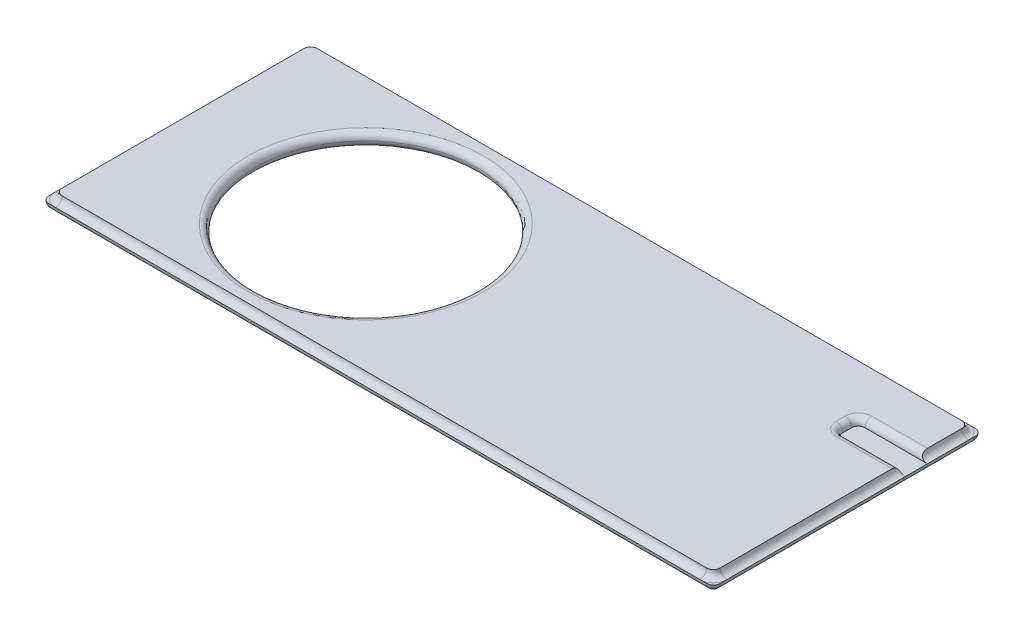
ISO-10303-21;
HEADER;
FILE_DESCRIPTION(('STEP AP214'),'2;1');
FILE_NAME('part.step','',(''),(''),'','','');
FILE_SCHEMA(('AUTOMOTIVE_DESIGN { 1 0 10303 214 1 1 1 1 }'));
ENDSEC;
DATA;
#1=APPLICATION_CONTEXT('core data for automotive mechanical design processes');
#2=APPLICATION_PROTOCOL_DEFINITION('international standard','automotive_design',2000,#1);
#3=PRODUCT_CONTEXT('',#1,'mechanical');
#4=PRODUCT('Part','Part','',(#3));
#5=PRODUCT_RELATED_PRODUCT_CATEGORY('part','',(#4));
#6=PRODUCT_DEFINITION_FORMATION('','',#4);
#7=PRODUCT_DEFINITION_CONTEXT('part definition',#1,'design');
#8=PRODUCT_DEFINITION('design','',#6,#7);
#9=PRODUCT_DEFINITION_SHAPE('','',#8);
#10=(LENGTH_UNIT() NAMED_UNIT(*) SI_UNIT(.MILLI.,.METRE.));
#11=(NAMED_UNIT(*) PLANE_ANGLE_UNIT() SI_UNIT($,.RADIAN.));
#12=(NAMED_UNIT(*) SI_UNIT($,.STERADIAN.) SOLID_ANGLE_UNIT());
#13=UNCERTAINTY_MEASURE_WITH_UNIT(LENGTH_MEASURE(1.E-05),#10,'distance_accuracy_value','');
#14=(GEOMETRIC_REPRESENTATION_CONTEXT(3) GLOBAL_UNCERTAINTY_ASSIGNED_CONTEXT((#13)) GLOBAL_UNIT_ASSIGNED_CONTEXT((#10,
#11,#12)) REPRESENTATION_CONTEXT('',''));
#15=CARTESIAN_POINT('',(0.,0.,0.));
#16=DIRECTION('',(0.,0.,1.));
#17=DIRECTION('',(1.,0.,0.));
#18=AXIS2_PLACEMENT_3D('',#15,#16,#17);
#19=CARTESIAN_POINT('',(100.,4.,-38.));
#20=DIRECTION('',(0.,0.,1.));
#21=DIRECTION('',(1.,0.,0.));
#22=AXIS2_PLACEMENT_3D('',#19,#20,#21);
#23=CYLINDRICAL_SURFACE('',#22,2.);
#24=DIRECTION('',(0.,0.,-1.));
#25=VECTOR('',#24,1.);
#26=CARTESIAN_POINT('',(100.,2.,36.));
#27=LINE('',#26,#25);
#28=CARTESIAN_POINT('',(100.,2.00000000000001,-17.1608981936858));
#29=VERTEX_POINT('',#28);
#30=CARTESIAN_POINT('',(100.,2.,36.));
#31=VERTEX_POINT('',#30);
#32=EDGE_CURVE('E216',#29,#31,#27,.F.);
#33=ORIENTED_EDGE('',*,*,#32,.F.);
#34=CARTESIAN_POINT('',(100.,2.00000000000001,-17.1608981936858));
#35=CARTESIAN_POINT('',(99.9443237196091,1.99999477382585,-17.1608812763882));
#36=CARTESIAN_POINT('',(99.8886498864098,2.0023248431153,-17.160897776983));
#37=CARTESIAN_POINT('',(99.7776902044235,2.01161556562429,-17.1608743192331));
#38=CARTESIAN_POINT('',(99.7224043532766,2.01857619065193,-17.1608343612321));
#39=CARTESIAN_POINT('',(99.6125064812738,2.03710429745034,-17.1605744660175));
#40=CARTESIAN_POINT('',(99.557895816533,2.04867986003021,-17.1603542123878));
#41=CARTESIAN_POINT('',(99.4498488761123,2.07634537812475,-17.1594877838668));
#42=CARTESIAN_POINT('',(99.3964125852468,2.09243527522871,-17.1588416144862));
#43=CARTESIAN_POINT('',(99.2383255375123,2.14735806605441,-17.1558063044473));
#44=CARTESIAN_POINT('',(99.1359163902609,2.19284070390969,-17.1523202018416));
#45=CARTESIAN_POINT('',(98.9404620253555,2.30006932532299,-17.1389899789227));
#46=CARTESIAN_POINT('',(98.8474083301739,2.36180039826343,-17.129151675835));
#47=CARTESIAN_POINT('',(98.7189707398691,2.46318241639044,-17.1068157486575));
#48=CARTESIAN_POINT('',(98.6787150797561,2.49767166863702,-17.098346324573));
#49=CARTESIAN_POINT('',(98.6014464543016,2.56933008262882,-17.0785126127619));
#50=CARTESIAN_POINT('',(98.5644317140234,2.60649775690457,-17.0671499230701));
#51=CARTESIAN_POINT('',(98.4939899390705,2.68294568903481,-17.0411138954848));
#52=CARTESIAN_POINT('',(98.4605593355672,2.72222378584753,-17.0264438968103));
#53=CARTESIAN_POINT('',(98.3975035692162,2.80224974734088,-16.9934574709362));
#54=CARTESIAN_POINT('',(98.3678777455406,2.84299735521259,-16.9751416783641));
#55=CARTESIAN_POINT('',(98.2925000429409,2.95514256017667,-16.9198566774541));
#56=CARTESIAN_POINT('',(98.2506459111748,3.02732535142565,-16.8789960119501));
#57=CARTESIAN_POINT('',(98.1787152328623,3.16974975751624,-16.7853833536057));
#58=CARTESIAN_POINT('',(98.1486391987491,3.23999128777529,-16.7326308435406));
#59=CARTESIAN_POINT('',(98.1003145339163,3.37088385385184,-16.6195708767724));
#60=CARTESIAN_POINT('',(98.0814820317776,3.4318546820201,-16.5598775226313));
#61=CARTESIAN_POINT('',(98.0512168171712,3.54639103408929,-16.4321346721791));
#62=CARTESIAN_POINT('',(98.039785886046,3.59995477288208,-16.3640831689899));
#63=CARTESIAN_POINT('',(98.0214307329307,3.70290029683522,-16.2140869790337));
#64=CARTESIAN_POINT('',(98.0150638480792,3.75134497193227,-16.1314338943138));
#65=CARTESIAN_POINT('',(98.0062783460999,3.83600253521547,-15.9598081316612));
#66=CARTESIAN_POINT('',(98.0038630193132,3.87220520998761,-15.8708302515186));
#67=CARTESIAN_POINT('',(98.0016146127977,3.91807160660776,-15.7298972361987));
#68=CARTESIAN_POINT('',(98.0011077110859,3.93233291451641,-15.6793980566494));
#69=CARTESIAN_POINT('',(98.000427662594,3.9568490683612,-15.5774189206616));
#70=CARTESIAN_POINT('',(98.0002545455301,3.96710355751288,-15.5259388773106));
#71=CARTESIAN_POINT('',(98.0000501120018,3.98352879910622,-15.422358893616));
#72=CARTESIAN_POINT('',(98.0000187286014,3.98970147806949,-15.3702592575432));
#73=CARTESIAN_POINT('',(98.0000003652994,3.99793901785092,-15.2657397312799));
#74=CARTESIAN_POINT('',(98.0000133824983,4.00000414689747,-15.2133198622253));
#75=CARTESIAN_POINT('',(98.,4.00000000000001,-15.1608981936858));
#76=B_SPLINE_CURVE_WITH_KNOTS('',3,(#34,#35,#36,#37,#38,#39,#40,#41,#42,#43,#44,#45,#46,#47,#48,
#49,#50,#51,#52,#53,#54,#55,#56,#57,#58,#59,#60,#61,#62,#63,#64,#65,#66,#67,#68,#69,#70,#71,#72,
#73,#74,#75),.UNSPECIFIED.,.F.,.F.,(4,2,2,2,2,2,2,2,2,2,2,2,2,2,2,2,2,2,2,2,4),(0.,
0.166975669456327,0.333950322335784,0.501218642994518,0.668484799478483,1.00307655016575,
1.33736232180719,1.49820683683046,1.65896270472558,1.81955698688305,1.98012333861254,
2.25720233723891,2.53429338948394,2.79534445721546,3.05645832900396,3.3433892350094,
3.63055893820404,3.78785058830356,3.94515624114186,4.10238759619616,4.25960868349995),.UNSPECIFIED.);
#77=CARTESIAN_POINT('',(98.,4.00000000000001,-15.1608981936858));
#78=VERTEX_POINT('',#77);
#79=EDGE_CURVE('E55',#29,#78,#76,.T.);
#80=ORIENTED_EDGE('',*,*,#79,.T.);
#81=DIRECTION('',(0.,0.,-1.));
#82=VECTOR('',#81,1.);
#83=CARTESIAN_POINT('',(98.,4.00000000000001,-38.));
#84=LINE('',#83,#82);
#85=CARTESIAN_POINT('',(98.,4.00000000000001,36.));
#86=VERTEX_POINT('',#85);
#87=EDGE_CURVE('E231',#86,#78,#84,.T.);
#88=ORIENTED_EDGE('',*,*,#87,.F.);
#89=CARTESIAN_POINT('',(100.,4.,36.));
#90=DIRECTION('',(0.,0.,1.));
#91=DIRECTION('',(1.,0.,0.));
#92=AXIS2_PLACEMENT_3D('',#89,#90,#91);
#93=CIRCLE('',#92,2.);
#94=EDGE_CURVE('E329',#86,#31,#93,.T.);
#95=ORIENTED_EDGE('',*,*,#94,.T.);
#96=EDGE_LOOP('',(#33,#80,#88,#95));
#97=FACE_BOUND('',#96,.T.);
#98=ADVANCED_FACE('F45',(#97),#23,.F.);
#99=CARTESIAN_POINT('',(98.,4.00000000000001,-25.7408981936858));
#100=VERTEX_POINT('',#99);
#101=CARTESIAN_POINT('',(98.,4.00000000000001,-36.));
#102=VERTEX_POINT('',#101);
#103=EDGE_CURVE('E195',#100,#102,#84,.T.);
#104=ORIENTED_EDGE('',*,*,#103,.F.);
#105=CARTESIAN_POINT('',(98.,4.00000000000001,-25.7408981936858));
#106=CARTESIAN_POINT('',(98.0000169172976,4.00000522617416,-25.6852219132949));
#107=CARTESIAN_POINT('',(98.0000004167028,3.9976751568847,-25.6295480800955));
#108=CARTESIAN_POINT('',(98.0000238744527,3.98838443437572,-25.5185883981093));
#109=CARTESIAN_POINT('',(98.0000638324536,3.98142380934808,-25.4633025469623));
#110=CARTESIAN_POINT('',(98.0003237276683,3.96289570254967,-25.3534046749595));
#111=CARTESIAN_POINT('',(98.000543981298,3.9513201399698,-25.2987940102187));
#112=CARTESIAN_POINT('',(98.001410409819,3.92365462187526,-25.190747069798));
#113=CARTESIAN_POINT('',(98.0020565791995,3.90756472477131,-25.1373107789326));
#114=CARTESIAN_POINT('',(98.0050918892385,3.85264193394561,-24.9792237311981));
#115=CARTESIAN_POINT('',(98.0085779918441,3.80715929609032,-24.8768145839466));
#116=CARTESIAN_POINT('',(98.021908214763,3.69993067467702,-24.6813602190412));
#117=CARTESIAN_POINT('',(98.0317465178508,3.63819960173658,-24.5883065238596));
#118=CARTESIAN_POINT('',(98.0540824450283,3.53681758360958,-24.4598689335549));
#119=CARTESIAN_POINT('',(98.0625518691128,3.502328331363,-24.4196132734419));
#120=CARTESIAN_POINT('',(98.0823855809239,3.43066991737119,-24.3423446479874));
#121=CARTESIAN_POINT('',(98.0937482706156,3.39350224309545,-24.3053299077092));
#122=CARTESIAN_POINT('',(98.1197842982009,3.31705431096521,-24.2348881327563));
#123=CARTESIAN_POINT('',(98.1344542968754,3.2777762141525,-24.201457529253));
#124=CARTESIAN_POINT('',(98.1674407227496,3.19775025265914,-24.138401762902));
#125=CARTESIAN_POINT('',(98.1857565153216,3.15700264478743,-24.1087759392263));
#126=CARTESIAN_POINT('',(98.2410415162317,3.04485743982335,-24.0333982366267));
#127=CARTESIAN_POINT('',(98.2819021817357,2.97267464857437,-23.9915441048605));
#128=CARTESIAN_POINT('',(98.37551484008,2.83025024248378,-23.919613426548));
#129=CARTESIAN_POINT('',(98.4282673501451,2.76000871222472,-23.8895373924349));
#130=CARTESIAN_POINT('',(98.5413273169133,2.62911614614817,-23.841212727602));
#131=CARTESIAN_POINT('',(98.6010206710544,2.56814531797991,-23.8223802254634));
#132=CARTESIAN_POINT('',(98.7287635215066,2.45360896591072,-23.792115010857));
#133=CARTESIAN_POINT('',(98.7968150246959,2.40004522711794,-23.7806840797318));
#134=CARTESIAN_POINT('',(98.9468112146521,2.29709970316479,-23.7623289266165));
#135=CARTESIAN_POINT('',(99.0294642993719,2.24865502806774,-23.755962041765));
#136=CARTESIAN_POINT('',(99.2010900620245,2.16399746478454,-23.7471765397856));
#137=CARTESIAN_POINT('',(99.2900679421672,2.1277947900124,-23.7447612129989));
#138=CARTESIAN_POINT('',(99.4310009574871,2.08192839339224,-23.7425128064834));
#139=CARTESIAN_POINT('',(99.4815001370364,2.0676670854836,-23.7420059047716));
#140=CARTESIAN_POINT('',(99.5834792730242,2.04315093163881,-23.7413258562797));
#141=CARTESIAN_POINT('',(99.6349593163752,2.03289644248713,-23.7411527392159));
#142=CARTESIAN_POINT('',(99.7385393000697,2.01647120089379,-23.7409483056875));
#143=CARTESIAN_POINT('',(99.7906389361425,2.01029852193052,-23.7409169222872));
#144=CARTESIAN_POINT('',(99.8951584624058,2.00206098214909,-23.7408985589852));
#145=CARTESIAN_POINT('',(99.9475783314605,1.99999585310255,-23.740911576184));
#146=CARTESIAN_POINT('',(100.,2.,-23.7408981936858));
#147=B_SPLINE_CURVE_WITH_KNOTS('',3,(#105,#106,#107,#108,#109,#110,#111,#112,#113,#114,#115,
#116,#117,#118,#119,#120,#121,#122,#123,#124,#125,#126,#127,#128,#129,#130,#131,#132,#133,#134,
#135,#136,#137,#138,#139,#140,#141,#142,#143,#144,#145,#146),.UNSPECIFIED.,.F.,.F.,(4,2,2,2,2,2,
2,2,2,2,2,2,2,2,2,2,2,2,2,2,4),(0.,0.166975669456348,0.333950322335805,0.501218642994511,
0.668484799478483,1.00307655016576,1.33736232180719,1.49820683683045,1.65896270472556,
1.81955698688304,1.98012333861253,2.2572023372389,2.53429338948394,2.79534445721545,
3.05645832900396,3.34338923500941,3.63055893820404,3.78785058830358,3.94515624114185,
4.10238759619614,4.25960868349993),.UNSPECIFIED.);
#148=CARTESIAN_POINT('',(100.,2.00000000000001,-23.7408981936858));
#149=VERTEX_POINT('',#148);
#150=EDGE_CURVE('E11',#100,#149,#147,.T.);
#151=ORIENTED_EDGE('',*,*,#150,.T.);
#152=CARTESIAN_POINT('',(100.,2.,-36.));
#153=VERTEX_POINT('',#152);
#154=EDGE_CURVE('E193',#153,#149,#27,.F.);
#155=ORIENTED_EDGE('',*,*,#154,.F.);
#156=CARTESIAN_POINT('',(100.,4.,-36.));
#157=DIRECTION('',(0.,0.,1.));
#158=DIRECTION('',(1.,0.,0.));
#159=AXIS2_PLACEMENT_3D('',#156,#157,#158);
#160=CIRCLE('',#159,2.);
#161=EDGE_CURVE('E317',#102,#153,#160,.T.);
#162=ORIENTED_EDGE('',*,*,#161,.F.);
#163=EDGE_LOOP('',(#104,#151,#155,#162));
#164=FACE_BOUND('',#163,.T.);
#165=ADVANCED_FACE('F190',(#164),#23,.F.);
#166=CARTESIAN_POINT('',(0.,2.,0.));
#167=DIRECTION('',(0.,-1.,0.));
#168=DIRECTION('',(0.,0.,-1.));
#169=AXIS2_PLACEMENT_3D('',#166,#167,#168);
#170=PLANE('',#169);
#171=DIRECTION('',(1.,0.,0.));
#172=VECTOR('',#171,1.);
#173=CARTESIAN_POINT('',(100.,2.,40.));
#174=LINE('',#173,#172);
#175=CARTESIAN_POINT('',(-98.,2.,40.));
#176=VERTEX_POINT('',#175);
#177=CARTESIAN_POINT('',(-96.,2.,40.));
#178=VERTEX_POINT('',#177);
#179=EDGE_CURVE('E239',#176,#178,#174,.T.);
#180=ORIENTED_EDGE('',*,*,#179,.T.);
#181=CARTESIAN_POINT('',(-96.,2.,36.));
#182=DIRECTION('',(0.,-1.,0.));
#183=DIRECTION('',(0.,0.,-1.));
#184=AXIS2_PLACEMENT_3D('',#181,#182,#183);
#185=CIRCLE('',#184,4.);
#186=CARTESIAN_POINT('',(-100.,2.,36.));
#187=VERTEX_POINT('',#186);
#188=EDGE_CURVE('E282',#178,#187,#185,.T.);
#189=ORIENTED_EDGE('',*,*,#188,.T.);
#190=DIRECTION('',(0.,0.,1.));
#191=VECTOR('',#190,1.);
#192=CARTESIAN_POINT('',(-100.,2.,-40.));
#193=LINE('',#192,#191);
#194=CARTESIAN_POINT('',(-100.,2.,38.));
#195=VERTEX_POINT('',#194);
#196=EDGE_CURVE('E235',#187,#195,#193,.T.);
#197=ORIENTED_EDGE('',*,*,#196,.T.);
#198=CARTESIAN_POINT('',(-98.,2.,38.));
#199=DIRECTION('',(0.,-1.,0.));
#200=DIRECTION('',(0.,0.,-1.));
#201=AXIS2_PLACEMENT_3D('',#198,#199,#200);
#202=CIRCLE('',#201,2.);
#203=EDGE_CURVE('E249',#195,#176,#202,.F.);
#204=ORIENTED_EDGE('',*,*,#203,.T.);
#205=EDGE_LOOP('',(#180,#189,#197,#204));
#206=FACE_BOUND('',#205,.T.);
#207=ADVANCED_FACE('F513',(#206),#170,.F.);
#208=CARTESIAN_POINT('',(-100.,2.,-38.));
#209=VERTEX_POINT('',#208);
#210=CARTESIAN_POINT('',(-100.,2.,-36.));
#211=VERTEX_POINT('',#210);
#212=EDGE_CURVE('E236',#209,#211,#193,.T.);
#213=ORIENTED_EDGE('',*,*,#212,.T.);
#214=CARTESIAN_POINT('',(-96.,2.,-36.));
#215=DIRECTION('',(0.,-1.,0.));
#216=DIRECTION('',(0.,0.,-1.));
#217=AXIS2_PLACEMENT_3D('',#214,#215,#216);
#218=CIRCLE('',#217,4.);
#219=CARTESIAN_POINT('',(-96.,2.,-40.));
#220=VERTEX_POINT('',#219);
#221=EDGE_CURVE('E280',#211,#220,#218,.T.);
#222=ORIENTED_EDGE('',*,*,#221,.T.);
#223=DIRECTION('',(-1.,0.,0.));
#224=VECTOR('',#223,1.);
#225=CARTESIAN_POINT('',(100.,2.,-40.));
#226=LINE('',#225,#224);
#227=CARTESIAN_POINT('',(-98.,2.,-40.));
#228=VERTEX_POINT('',#227);
#229=EDGE_CURVE('E245',#220,#228,#226,.T.);
#230=ORIENTED_EDGE('',*,*,#229,.T.);
#231=CARTESIAN_POINT('',(-98.,2.,-38.));
#232=DIRECTION('',(0.,-1.,0.));
#233=DIRECTION('',(0.,0.,-1.));
#234=AXIS2_PLACEMENT_3D('',#231,#232,#233);
#235=CIRCLE('',#234,2.);
#236=EDGE_CURVE('E255',#228,#209,#235,.F.);
#237=ORIENTED_EDGE('',*,*,#236,.T.);
#238=EDGE_LOOP('',(#213,#222,#230,#237));
#239=FACE_BOUND('',#238,.T.);
#240=ADVANCED_FACE('F456',(#239),#170,.F.);
#241=CARTESIAN_POINT('',(98.,2.,-40.));
#242=VERTEX_POINT('',#241);
#243=CARTESIAN_POINT('',(96.,2.,-40.));
#244=VERTEX_POINT('',#243);
#245=EDGE_CURVE('E246',#242,#244,#226,.T.);
#246=ORIENTED_EDGE('',*,*,#245,.T.);
#247=CARTESIAN_POINT('',(96.,2.,-36.));
#248=DIRECTION('',(0.,-1.,0.));
#249=DIRECTION('',(0.,0.,-1.));
#250=AXIS2_PLACEMENT_3D('',#247,#248,#249);
#251=CIRCLE('',#250,4.);
#252=EDGE_CURVE('E278',#244,#153,#251,.T.);
#253=ORIENTED_EDGE('',*,*,#252,.T.);
#254=DIRECTION('',(0.,0.,-1.));
#255=VECTOR('',#254,1.);
#256=CARTESIAN_POINT('',(100.,2.,-40.));
#257=LINE('',#256,#255);
#258=CARTESIAN_POINT('',(100.,2.,-38.));
#259=VERTEX_POINT('',#258);
#260=EDGE_CURVE('E214',#153,#259,#257,.T.);
#261=ORIENTED_EDGE('',*,*,#260,.T.);
#262=CARTESIAN_POINT('',(98.,2.,-38.));
#263=DIRECTION('',(0.,-1.,0.));
#264=DIRECTION('',(0.,0.,-1.));
#265=AXIS2_PLACEMENT_3D('',#262,#263,#264);
#266=CIRCLE('',#265,2.);
#267=EDGE_CURVE('E253',#259,#242,#266,.F.);
#268=ORIENTED_EDGE('',*,*,#267,.T.);
#269=EDGE_LOOP('',(#246,#253,#261,#268));
#270=FACE_BOUND('',#269,.T.);
#271=ADVANCED_FACE('F469',(#270),#170,.F.);
#272=CARTESIAN_POINT('',(100.,2.,38.));
#273=VERTEX_POINT('',#272);
#274=EDGE_CURVE('E242',#273,#31,#257,.T.);
#275=ORIENTED_EDGE('',*,*,#274,.T.);
#276=CARTESIAN_POINT('',(96.,2.,36.));
#277=DIRECTION('',(0.,-1.,0.));
#278=DIRECTION('',(0.,0.,-1.));
#279=AXIS2_PLACEMENT_3D('',#276,#277,#278);
#280=CIRCLE('',#279,4.);
#281=CARTESIAN_POINT('',(96.,2.,40.));
#282=VERTEX_POINT('',#281);
#283=EDGE_CURVE('E276',#31,#282,#280,.T.);
#284=ORIENTED_EDGE('',*,*,#283,.T.);
#285=CARTESIAN_POINT('',(98.,2.,40.));
#286=VERTEX_POINT('',#285);
#287=EDGE_CURVE('E238',#282,#286,#174,.T.);
#288=ORIENTED_EDGE('',*,*,#287,.T.);
#289=CARTESIAN_POINT('',(98.,2.,38.));
#290=DIRECTION('',(0.,-1.,0.));
#291=DIRECTION('',(0.,0.,-1.));
#292=AXIS2_PLACEMENT_3D('',#289,#290,#291);
#293=CIRCLE('',#292,2.);
#294=EDGE_CURVE('E251',#286,#273,#293,.F.);
#295=ORIENTED_EDGE('',*,*,#294,.T.);
#296=EDGE_LOOP('',(#275,#284,#288,#295));
#297=FACE_BOUND('',#296,.T.);
#298=ADVANCED_FACE('F427',(#297),#170,.F.);
#299=CARTESIAN_POINT('',(0.,0.,0.));
#300=DIRECTION('',(0.,-1.,0.));
#301=DIRECTION('',(0.,0.,-1.));
#302=AXIS2_PLACEMENT_3D('',#299,#300,#301);
#303=PLANE('',#302);
#304=CARTESIAN_POINT('',(-43.56,0.,0.));
#305=DIRECTION('',(0.,-1.,0.));
#306=DIRECTION('',(0.,0.,-1.));
#307=AXIS2_PLACEMENT_3D('',#304,#305,#306);
#308=CIRCLE('',#307,35.0721631171338);
#309=CARTESIAN_POINT('',(-43.56,0.,-35.0721631171338));
#310=VERTEX_POINT('',#309);
#311=EDGE_CURVE('E336',#310,#310,#308,.F.);
#312=ORIENTED_EDGE('',*,*,#311,.T.);
#313=EDGE_LOOP('',(#312));
#314=FACE_BOUND('',#313,.T.);
#315=DIRECTION('',(0.,0.,1.));
#316=VECTOR('',#315,1.);
#317=CARTESIAN_POINT('',(-98.,0.,-38.));
#318=LINE('',#317,#316);
#319=CARTESIAN_POINT('',(-98.,0.,38.));
#320=VERTEX_POINT('',#319);
#321=CARTESIAN_POINT('',(-98.,0.,-38.));
#322=VERTEX_POINT('',#321);
#323=EDGE_CURVE('E267',#320,#322,#318,.F.);
#324=ORIENTED_EDGE('',*,*,#323,.T.);
#325=DIRECTION('',(-1.,0.,0.));
#326=VECTOR('',#325,1.);
#327=CARTESIAN_POINT('',(98.,0.,-38.));
#328=LINE('',#327,#326);
#329=CARTESIAN_POINT('',(98.,0.,-38.));
#330=VERTEX_POINT('',#329);
#331=EDGE_CURVE('E273',#322,#330,#328,.F.);
#332=ORIENTED_EDGE('',*,*,#331,.T.);
#333=DIRECTION('',(0.,0.,-1.));
#334=VECTOR('',#333,1.);
#335=CARTESIAN_POINT('',(98.,0.,38.));
#336=LINE('',#335,#334);
#337=CARTESIAN_POINT('',(98.,0.,38.));
#338=VERTEX_POINT('',#337);
#339=EDGE_CURVE('E271',#330,#338,#336,.F.);
#340=ORIENTED_EDGE('',*,*,#339,.T.);
#341=DIRECTION('',(1.,0.,0.));
#342=VECTOR('',#341,1.);
#343=CARTESIAN_POINT('',(-98.,0.,38.));
#344=LINE('',#343,#342);
#345=EDGE_CURVE('E269',#338,#320,#344,.F.);
#346=ORIENTED_EDGE('',*,*,#345,.T.);
#347=EDGE_LOOP('',(#324,#332,#340,#346));
#348=FACE_BOUND('',#347,.T.);
#349=ADVANCED_FACE('F440',(#314,#348),#303,.T.);
#350=CARTESIAN_POINT('',(0.,4.00000000000001,0.));
#351=DIRECTION('',(0.,-1.,0.));
#352=DIRECTION('',(0.,0.,-1.));
#353=AXIS2_PLACEMENT_3D('',#350,#351,#352);
#354=PLANE('',#353);
#355=CARTESIAN_POINT('',(-43.56,4.00000000000001,0.));
#356=DIRECTION('',(0.,-1.,0.));
#357=DIRECTION('',(0.,0.,-1.));
#358=AXIS2_PLACEMENT_3D('',#355,#356,#357);
#359=CIRCLE('',#358,35.0721631171338);
#360=CARTESIAN_POINT('',(-43.56,4.00000000000001,-35.0721631171338));
#361=VERTEX_POINT('',#360);
#362=EDGE_CURVE('E339',#361,#361,#359,.T.);
#363=ORIENTED_EDGE('',*,*,#362,.T.);
#364=EDGE_LOOP('',(#363));
#365=FACE_BOUND('',#364,.T.);
#366=ORIENTED_EDGE('',*,*,#87,.T.);
#367=DIRECTION('',(1.,0.,0.));
#368=VECTOR('',#367,1.);
#369=CARTESIAN_POINT('',(0.,4.00000000000001,-15.1608981936858));
#370=LINE('',#369,#368);
#371=CARTESIAN_POINT('',(81.4188022011959,4.00000000000001,-15.1608981936858));
#372=VERTEX_POINT('',#371);
#373=EDGE_CURVE('E63',#78,#372,#370,.F.);
#374=ORIENTED_EDGE('',*,*,#373,.T.);
#375=CARTESIAN_POINT('',(81.4188022011959,4.00000000000001,-19.1608981936858));
#376=DIRECTION('',(0.,-1.,0.));
#377=DIRECTION('',(0.,0.,-1.));
#378=AXIS2_PLACEMENT_3D('',#375,#376,#377);
#379=CIRCLE('',#378,4.);
#380=CARTESIAN_POINT('',(77.4188022011959,4.00000000000001,-19.1608981936858));
#381=VERTEX_POINT('',#380);
#382=EDGE_CURVE('E352',#372,#381,#379,.T.);
#383=ORIENTED_EDGE('',*,*,#382,.T.);
#384=DIRECTION('',(0.,0.,1.));
#385=VECTOR('',#384,1.);
#386=CARTESIAN_POINT('',(77.4188022011959,4.00000000000001,0.));
#387=LINE('',#386,#385);
#388=CARTESIAN_POINT('',(77.4188022011959,4.00000000000001,-21.7408981936858));
#389=VERTEX_POINT('',#388);
#390=EDGE_CURVE('E350',#381,#389,#387,.F.);
#391=ORIENTED_EDGE('',*,*,#390,.T.);
#392=CARTESIAN_POINT('',(81.4188022011959,4.00000000000001,-21.7408981936858));
#393=DIRECTION('',(0.,-1.,0.));
#394=DIRECTION('',(0.,0.,-1.));
#395=AXIS2_PLACEMENT_3D('',#392,#393,#394);
#396=CIRCLE('',#395,4.);
#397=CARTESIAN_POINT('',(81.4188022011959,4.00000000000001,-25.7408981936858));
#398=VERTEX_POINT('',#397);
#399=EDGE_CURVE('E348',#389,#398,#396,.T.);
#400=ORIENTED_EDGE('',*,*,#399,.T.);
#401=DIRECTION('',(-1.,0.,0.));
#402=VECTOR('',#401,1.);
#403=CARTESIAN_POINT('',(0.,4.00000000000001,-25.7408981936857));
#404=LINE('',#403,#402);
#405=EDGE_CURVE('E346',#398,#100,#404,.F.);
#406=ORIENTED_EDGE('',*,*,#405,.T.);
#407=ORIENTED_EDGE('',*,*,#103,.T.);
#408=CARTESIAN_POINT('',(96.,4.00000000000001,-36.));
#409=DIRECTION('',(0.,-1.,0.));
#410=DIRECTION('',(0.,0.,-1.));
#411=AXIS2_PLACEMENT_3D('',#408,#409,#410);
#412=CIRCLE('',#411,2.);
#413=CARTESIAN_POINT('',(96.,4.00000000000001,-38.));
#414=VERTEX_POINT('',#413);
#415=EDGE_CURVE('E265',#102,#414,#412,.F.);
#416=ORIENTED_EDGE('',*,*,#415,.T.);
#417=DIRECTION('',(-1.,0.,0.));
#418=VECTOR('',#417,1.);
#419=CARTESIAN_POINT('',(98.,4.00000000000001,-38.));
#420=LINE('',#419,#418);
#421=CARTESIAN_POINT('',(-96.,4.00000000000001,-38.));
#422=VERTEX_POINT('',#421);
#423=EDGE_CURVE('E233',#414,#422,#420,.T.);
#424=ORIENTED_EDGE('',*,*,#423,.T.);
#425=CARTESIAN_POINT('',(-96.,4.00000000000001,-36.));
#426=DIRECTION('',(0.,-1.,0.));
#427=DIRECTION('',(0.,0.,-1.));
#428=AXIS2_PLACEMENT_3D('',#425,#426,#427);
#429=CIRCLE('',#428,2.);
#430=CARTESIAN_POINT('',(-98.,4.00000000000001,-36.));
#431=VERTEX_POINT('',#430);
#432=EDGE_CURVE('E258',#422,#431,#429,.F.);
#433=ORIENTED_EDGE('',*,*,#432,.T.);
#434=DIRECTION('',(0.,0.,1.));
#435=VECTOR('',#434,1.);
#436=CARTESIAN_POINT('',(-98.,4.00000000000001,-38.));
#437=LINE('',#436,#435);
#438=CARTESIAN_POINT('',(-98.,4.00000000000001,36.));
#439=VERTEX_POINT('',#438);
#440=EDGE_CURVE('E226',#431,#439,#437,.T.);
#441=ORIENTED_EDGE('',*,*,#440,.T.);
#442=CARTESIAN_POINT('',(-96.,4.00000000000001,36.));
#443=DIRECTION('',(0.,-1.,0.));
#444=DIRECTION('',(0.,0.,-1.));
#445=AXIS2_PLACEMENT_3D('',#442,#443,#444);
#446=CIRCLE('',#445,2.);
#447=CARTESIAN_POINT('',(-96.,4.00000000000001,38.));
#448=VERTEX_POINT('',#447);
#449=EDGE_CURVE('E260',#439,#448,#446,.F.);
#450=ORIENTED_EDGE('',*,*,#449,.T.);
#451=DIRECTION('',(1.,0.,0.));
#452=VECTOR('',#451,1.);
#453=CARTESIAN_POINT('',(98.,4.00000000000001,38.));
#454=LINE('',#453,#452);
#455=CARTESIAN_POINT('',(96.,4.00000000000001,38.));
#456=VERTEX_POINT('',#455);
#457=EDGE_CURVE('E228',#448,#456,#454,.T.);
#458=ORIENTED_EDGE('',*,*,#457,.T.);
#459=CARTESIAN_POINT('',(96.,4.00000000000001,36.));
#460=DIRECTION('',(0.,-1.,0.));
#461=DIRECTION('',(0.,0.,-1.));
#462=AXIS2_PLACEMENT_3D('',#459,#460,#461);
#463=CIRCLE('',#462,2.);
#464=EDGE_CURVE('E263',#456,#86,#463,.F.);
#465=ORIENTED_EDGE('',*,*,#464,.T.);
#466=EDGE_LOOP('',(#366,#374,#383,#391,#400,#406,#407,#416,#424,#433,#441,#450,#458,#465));
#467=FACE_BOUND('',#466,.T.);
#468=ADVANCED_FACE('F388',(#365,#467),#354,.F.);
#469=CARTESIAN_POINT('',(96.,4.,36.));
#470=DIRECTION('',(0.,-1.,0.));
#471=DIRECTION('',(0.,0.,-1.));
#472=AXIS2_PLACEMENT_3D('',#469,#470,#471);
#473=TOROIDAL_SURFACE('',#472,4.,2.);
#474=ORIENTED_EDGE('',*,*,#94,.F.);
#475=ORIENTED_EDGE('',*,*,#464,.F.);
#476=CARTESIAN_POINT('',(96.,4.,40.));
#477=DIRECTION('',(1.,0.,0.));
#478=DIRECTION('',(0.,0.,-1.));
#479=AXIS2_PLACEMENT_3D('',#476,#477,#478);
#480=CIRCLE('',#479,2.);
#481=EDGE_CURVE('E229',#282,#456,#480,.T.);
#482=ORIENTED_EDGE('',*,*,#481,.F.);
#483=ORIENTED_EDGE('',*,*,#283,.F.);
#484=EDGE_LOOP('',(#474,#475,#482,#483));
#485=FACE_BOUND('',#484,.T.);
#486=ADVANCED_FACE('F384',(#485),#473,.F.);
#487=CARTESIAN_POINT('',(98.,4.,40.));
#488=DIRECTION('',(-1.,0.,0.));
#489=DIRECTION('',(0.,0.,1.));
#490=AXIS2_PLACEMENT_3D('',#487,#488,#489);
#491=CYLINDRICAL_SURFACE('',#490,2.);
#492=ORIENTED_EDGE('',*,*,#481,.T.);
#493=ORIENTED_EDGE('',*,*,#457,.F.);
#494=CARTESIAN_POINT('',(-96.,4.,40.));
#495=DIRECTION('',(1.,0.,0.));
#496=DIRECTION('',(0.,0.,-1.));
#497=AXIS2_PLACEMENT_3D('',#494,#495,#496);
#498=CIRCLE('',#497,2.);
#499=EDGE_CURVE('E327',#178,#448,#498,.T.);
#500=ORIENTED_EDGE('',*,*,#499,.F.);
#501=DIRECTION('',(1.,0.,0.));
#502=VECTOR('',#501,1.);
#503=CARTESIAN_POINT('',(-96.,2.,40.));
#504=LINE('',#503,#502);
#505=EDGE_CURVE('E324',#282,#178,#504,.F.);
#506=ORIENTED_EDGE('',*,*,#505,.F.);
#507=EDGE_LOOP('',(#492,#493,#500,#506));
#508=FACE_BOUND('',#507,.T.);
#509=ADVANCED_FACE('F380',(#508),#491,.F.);
#510=CARTESIAN_POINT('',(98.,2.,38.));
#511=DIRECTION('',(0.,-1.,0.));
#512=DIRECTION('',(0.,0.,-1.));
#513=AXIS2_PLACEMENT_3D('',#510,#511,#512);
#514=SPHERICAL_SURFACE('',#513,2.);
#515=CARTESIAN_POINT('',(98.,2.,38.));
#516=DIRECTION('',(0.,0.,-1.));
#517=DIRECTION('',(-1.,0.,0.));
#518=AXIS2_PLACEMENT_3D('',#515,#516,#517);
#519=CIRCLE('',#518,2.);
#520=EDGE_CURVE('E215',#273,#338,#519,.T.);
#521=ORIENTED_EDGE('',*,*,#520,.F.);
#522=ORIENTED_EDGE('',*,*,#294,.F.);
#523=CARTESIAN_POINT('',(98.,2.,38.));
#524=DIRECTION('',(-1.,0.,0.));
#525=DIRECTION('',(0.,0.,1.));
#526=AXIS2_PLACEMENT_3D('',#523,#524,#525);
#527=CIRCLE('',#526,2.);
#528=EDGE_CURVE('E321',#338,#286,#527,.T.);
#529=ORIENTED_EDGE('',*,*,#528,.F.);
#530=EDGE_LOOP('',(#521,#522,#529));
#531=FACE_BOUND('',#530,.T.);
#532=ADVANCED_FACE('F376',(#531),#514,.T.);
#533=CARTESIAN_POINT('',(-96.,4.,36.));
#534=DIRECTION('',(0.,-1.,0.));
#535=DIRECTION('',(0.,0.,-1.));
#536=AXIS2_PLACEMENT_3D('',#533,#534,#535);
#537=TOROIDAL_SURFACE('',#536,4.,2.);
#538=ORIENTED_EDGE('',*,*,#499,.T.);
#539=ORIENTED_EDGE('',*,*,#449,.F.);
#540=CARTESIAN_POINT('',(-100.,4.,36.));
#541=DIRECTION('',(0.,0.,1.));
#542=DIRECTION('',(1.,0.,0.));
#543=AXIS2_PLACEMENT_3D('',#540,#541,#542);
#544=CIRCLE('',#543,2.);
#545=EDGE_CURVE('E311',#187,#439,#544,.T.);
#546=ORIENTED_EDGE('',*,*,#545,.F.);
#547=ORIENTED_EDGE('',*,*,#188,.F.);
#548=EDGE_LOOP('',(#538,#539,#546,#547));
#549=FACE_BOUND('',#548,.T.);
#550=ADVANCED_FACE('F374',(#549),#537,.F.);
#551=CARTESIAN_POINT('',(100.,2.,38.));
#552=DIRECTION('',(-1.,0.,0.));
#553=DIRECTION('',(0.,0.,1.));
#554=AXIS2_PLACEMENT_3D('',#551,#552,#553);
#555=CYLINDRICAL_SURFACE('',#554,2.);
#556=ORIENTED_EDGE('',*,*,#505,.T.);
#557=ORIENTED_EDGE('',*,*,#179,.F.);
#558=CARTESIAN_POINT('',(-98.,2.,38.));
#559=DIRECTION('',(-1.,0.,0.));
#560=DIRECTION('',(0.,0.,1.));
#561=AXIS2_PLACEMENT_3D('',#558,#559,#560);
#562=CIRCLE('',#561,2.);
#563=EDGE_CURVE('E308',#320,#176,#562,.T.);
#564=ORIENTED_EDGE('',*,*,#563,.F.);
#565=ORIENTED_EDGE('',*,*,#345,.F.);
#566=ORIENTED_EDGE('',*,*,#528,.T.);
#567=ORIENTED_EDGE('',*,*,#287,.F.);
#568=EDGE_LOOP('',(#556,#557,#564,#565,#566,#567));
#569=FACE_BOUND('',#568,.T.);
#570=ADVANCED_FACE('F436',(#569),#555,.T.);
#571=CARTESIAN_POINT('',(98.,2.,-40.));
#572=DIRECTION('',(0.,0.,1.));
#573=DIRECTION('',(1.,0.,0.));
#574=AXIS2_PLACEMENT_3D('',#571,#572,#573);
#575=CYLINDRICAL_SURFACE('',#574,2.);
#576=ORIENTED_EDGE('',*,*,#520,.T.);
#577=ORIENTED_EDGE('',*,*,#339,.F.);
#578=CARTESIAN_POINT('',(98.,2.,-38.));
#579=DIRECTION('',(0.,0.,-1.));
#580=DIRECTION('',(-1.,0.,0.));
#581=AXIS2_PLACEMENT_3D('',#578,#579,#580);
#582=CIRCLE('',#581,2.);
#583=EDGE_CURVE('E305',#259,#330,#582,.T.);
#584=ORIENTED_EDGE('',*,*,#583,.F.);
#585=ORIENTED_EDGE('',*,*,#260,.F.);
#586=ORIENTED_EDGE('',*,*,#154,.T.);
#587=DIRECTION('',(0.,0.,1.));
#588=VECTOR('',#587,1.);
#589=CARTESIAN_POINT('',(100.,2.00000000000001,-40.));
#590=LINE('',#589,#588);
#591=EDGE_CURVE('E201',#149,#29,#590,.T.);
#592=ORIENTED_EDGE('',*,*,#591,.T.);
#593=ORIENTED_EDGE('',*,*,#32,.T.);
#594=ORIENTED_EDGE('',*,*,#274,.F.);
#595=EDGE_LOOP('',(#576,#577,#584,#585,#586,#592,#593,#594));
#596=FACE_BOUND('',#595,.T.);
#597=ADVANCED_FACE('F212',(#596),#575,.T.);
#598=CARTESIAN_POINT('',(96.,4.,-36.));
#599=DIRECTION('',(0.,-1.,0.));
#600=DIRECTION('',(0.,0.,-1.));
#601=AXIS2_PLACEMENT_3D('',#598,#599,#600);
#602=TOROIDAL_SURFACE('',#601,4.,2.);
#603=ORIENTED_EDGE('',*,*,#161,.T.);
#604=ORIENTED_EDGE('',*,*,#252,.F.);
#605=CARTESIAN_POINT('',(96.,4.,-40.));
#606=DIRECTION('',(1.,0.,0.));
#607=DIRECTION('',(0.,0.,-1.));
#608=AXIS2_PLACEMENT_3D('',#605,#606,#607);
#609=CIRCLE('',#608,2.);
#610=EDGE_CURVE('E302',#414,#244,#609,.T.);
#611=ORIENTED_EDGE('',*,*,#610,.F.);
#612=ORIENTED_EDGE('',*,*,#415,.F.);
#613=EDGE_LOOP('',(#603,#604,#611,#612));
#614=FACE_BOUND('',#613,.T.);
#615=ADVANCED_FACE('F467',(#614),#602,.F.);
#616=CARTESIAN_POINT('',(-96.,4.,-36.));
#617=DIRECTION('',(0.,-1.,0.));
#618=DIRECTION('',(0.,0.,-1.));
#619=AXIS2_PLACEMENT_3D('',#616,#617,#618);
#620=TOROIDAL_SURFACE('',#619,4.,2.);
#621=CARTESIAN_POINT('',(-100.,4.,-36.));
#622=DIRECTION('',(0.,0.,-1.));
#623=DIRECTION('',(-1.,0.,0.));
#624=AXIS2_PLACEMENT_3D('',#621,#622,#623);
#625=CIRCLE('',#624,2.);
#626=EDGE_CURVE('E314',#431,#211,#625,.T.);
#627=ORIENTED_EDGE('',*,*,#626,.F.);
#628=ORIENTED_EDGE('',*,*,#432,.F.);
#629=CARTESIAN_POINT('',(-96.,4.,-40.));
#630=DIRECTION('',(-1.,0.,0.));
#631=DIRECTION('',(0.,0.,1.));
#632=AXIS2_PLACEMENT_3D('',#629,#630,#631);
#633=CIRCLE('',#632,2.);
#634=EDGE_CURVE('E299',#220,#422,#633,.T.);
#635=ORIENTED_EDGE('',*,*,#634,.F.);
#636=ORIENTED_EDGE('',*,*,#221,.F.);
#637=EDGE_LOOP('',(#627,#628,#635,#636));
#638=FACE_BOUND('',#637,.T.);
#639=ADVANCED_FACE('F488',(#638),#620,.F.);
#640=CARTESIAN_POINT('',(-100.,4.,-38.));
#641=DIRECTION('',(0.,0.,-1.));
#642=DIRECTION('',(-1.,0.,0.));
#643=AXIS2_PLACEMENT_3D('',#640,#641,#642);
#644=CYLINDRICAL_SURFACE('',#643,2.);
#645=ORIENTED_EDGE('',*,*,#440,.F.);
#646=ORIENTED_EDGE('',*,*,#626,.T.);
#647=DIRECTION('',(0.,0.,1.));
#648=VECTOR('',#647,1.);
#649=CARTESIAN_POINT('',(-100.,2.,-36.));
#650=LINE('',#649,#648);
#651=EDGE_CURVE('E296',#187,#211,#650,.F.);
#652=ORIENTED_EDGE('',*,*,#651,.F.);
#653=ORIENTED_EDGE('',*,*,#545,.T.);
#654=EDGE_LOOP('',(#645,#646,#652,#653));
#655=FACE_BOUND('',#654,.T.);
#656=ADVANCED_FACE('F481',(#655),#644,.F.);
#657=CARTESIAN_POINT('',(-98.,2.,38.));
#658=DIRECTION('',(0.,-1.,0.));
#659=DIRECTION('',(0.,0.,-1.));
#660=AXIS2_PLACEMENT_3D('',#657,#658,#659);
#661=SPHERICAL_SURFACE('',#660,2.);
#662=ORIENTED_EDGE('',*,*,#563,.T.);
#663=ORIENTED_EDGE('',*,*,#203,.F.);
#664=CARTESIAN_POINT('',(-98.,2.,38.));
#665=DIRECTION('',(0.,0.,-1.));
#666=DIRECTION('',(-1.,0.,0.));
#667=AXIS2_PLACEMENT_3D('',#664,#665,#666);
#668=CIRCLE('',#667,2.);
#669=EDGE_CURVE('E293',#320,#195,#668,.T.);
#670=ORIENTED_EDGE('',*,*,#669,.F.);
#671=EDGE_LOOP('',(#662,#663,#670));
#672=FACE_BOUND('',#671,.T.);
#673=ADVANCED_FACE('F474',(#672),#661,.T.);
#674=CARTESIAN_POINT('',(98.,2.,-38.));
#675=DIRECTION('',(0.,-1.,0.));
#676=DIRECTION('',(0.,0.,-1.));
#677=AXIS2_PLACEMENT_3D('',#674,#675,#676);
#678=SPHERICAL_SURFACE('',#677,2.);
#679=ORIENTED_EDGE('',*,*,#267,.F.);
#680=ORIENTED_EDGE('',*,*,#583,.T.);
#681=CARTESIAN_POINT('',(98.,2.,-38.));
#682=DIRECTION('',(-1.,0.,0.));
#683=DIRECTION('',(0.,0.,1.));
#684=AXIS2_PLACEMENT_3D('',#681,#682,#683);
#685=CIRCLE('',#684,2.);
#686=EDGE_CURVE('E291',#242,#330,#685,.T.);
#687=ORIENTED_EDGE('',*,*,#686,.F.);
#688=EDGE_LOOP('',(#679,#680,#687));
#689=FACE_BOUND('',#688,.T.);
#690=ADVANCED_FACE('F472',(#689),#678,.T.);
#691=CARTESIAN_POINT('',(98.,4.,-40.));
#692=DIRECTION('',(1.,0.,0.));
#693=DIRECTION('',(0.,0.,-1.));
#694=AXIS2_PLACEMENT_3D('',#691,#692,#693);
#695=CYLINDRICAL_SURFACE('',#694,2.);
#696=ORIENTED_EDGE('',*,*,#423,.F.);
#697=ORIENTED_EDGE('',*,*,#610,.T.);
#698=DIRECTION('',(-1.,0.,0.));
#699=VECTOR('',#698,1.);
#700=CARTESIAN_POINT('',(96.,2.,-40.));
#701=LINE('',#700,#699);
#702=EDGE_CURVE('E289',#220,#244,#701,.F.);
#703=ORIENTED_EDGE('',*,*,#702,.F.);
#704=ORIENTED_EDGE('',*,*,#634,.T.);
#705=EDGE_LOOP('',(#696,#697,#703,#704));
#706=FACE_BOUND('',#705,.T.);
#707=ADVANCED_FACE('F464',(#706),#695,.F.);
#708=CARTESIAN_POINT('',(-98.,2.,-40.));
#709=DIRECTION('',(0.,0.,-1.));
#710=DIRECTION('',(-1.,0.,0.));
#711=AXIS2_PLACEMENT_3D('',#708,#709,#710);
#712=CYLINDRICAL_SURFACE('',#711,2.);
#713=ORIENTED_EDGE('',*,*,#651,.T.);
#714=ORIENTED_EDGE('',*,*,#212,.F.);
#715=CARTESIAN_POINT('',(-98.,2.,-38.));
#716=DIRECTION('',(0.,0.,-1.));
#717=DIRECTION('',(-1.,0.,0.));
#718=AXIS2_PLACEMENT_3D('',#715,#716,#717);
#719=CIRCLE('',#718,2.);
#720=EDGE_CURVE('E287',#322,#209,#719,.T.);
#721=ORIENTED_EDGE('',*,*,#720,.F.);
#722=ORIENTED_EDGE('',*,*,#323,.F.);
#723=ORIENTED_EDGE('',*,*,#669,.T.);
#724=ORIENTED_EDGE('',*,*,#196,.F.);
#725=EDGE_LOOP('',(#713,#714,#721,#722,#723,#724));
#726=FACE_BOUND('',#725,.T.);
#727=ADVANCED_FACE('F452',(#726),#712,.T.);
#728=CARTESIAN_POINT('',(100.,2.,-38.));
#729=DIRECTION('',(1.,0.,0.));
#730=DIRECTION('',(0.,0.,-1.));
#731=AXIS2_PLACEMENT_3D('',#728,#729,#730);
#732=CYLINDRICAL_SURFACE('',#731,2.);
#733=ORIENTED_EDGE('',*,*,#686,.T.);
#734=ORIENTED_EDGE('',*,*,#331,.F.);
#735=CARTESIAN_POINT('',(-98.,2.,-38.));
#736=DIRECTION('',(-1.,0.,0.));
#737=DIRECTION('',(0.,0.,1.));
#738=AXIS2_PLACEMENT_3D('',#735,#736,#737);
#739=CIRCLE('',#738,2.);
#740=EDGE_CURVE('E225',#228,#322,#739,.T.);
#741=ORIENTED_EDGE('',*,*,#740,.F.);
#742=ORIENTED_EDGE('',*,*,#229,.F.);
#743=ORIENTED_EDGE('',*,*,#702,.T.);
#744=ORIENTED_EDGE('',*,*,#245,.F.);
#745=EDGE_LOOP('',(#733,#734,#741,#742,#743,#744));
#746=FACE_BOUND('',#745,.T.);
#747=ADVANCED_FACE('F446',(#746),#732,.T.);
#748=CARTESIAN_POINT('',(-98.,2.,-38.));
#749=DIRECTION('',(0.,-1.,0.));
#750=DIRECTION('',(0.,0.,-1.));
#751=AXIS2_PLACEMENT_3D('',#748,#749,#750);
#752=SPHERICAL_SURFACE('',#751,2.);
#753=ORIENTED_EDGE('',*,*,#720,.T.);
#754=ORIENTED_EDGE('',*,*,#236,.F.);
#755=ORIENTED_EDGE('',*,*,#740,.T.);
#756=EDGE_LOOP('',(#753,#754,#755));
#757=FACE_BOUND('',#756,.T.);
#758=ADVANCED_FACE('F394',(#757),#752,.T.);
#759=CARTESIAN_POINT('',(-43.56,2.,0.));
#760=DIRECTION('',(0.,-1.,0.));
#761=DIRECTION('',(0.,0.,-1.));
#762=AXIS2_PLACEMENT_3D('',#759,#760,#761);
#763=TOROIDAL_SURFACE('',#762,35.0721631171338,2.);
#764=ORIENTED_EDGE('',*,*,#311,.F.);
#765=EDGE_LOOP('',(#764));
#766=FACE_BOUND('',#765,.T.);
#767=CARTESIAN_POINT('',(-43.56,2.,0.));
#768=DIRECTION('',(0.,-1.,0.));
#769=DIRECTION('',(0.,0.,-1.));
#770=AXIS2_PLACEMENT_3D('',#767,#768,#769);
#771=CIRCLE('',#770,33.0721631171338);
#772=CARTESIAN_POINT('',(-43.56,2.,-33.0721631171338));
#773=VERTEX_POINT('',#772);
#774=EDGE_CURVE('E284',#773,#773,#771,.T.);
#775=ORIENTED_EDGE('',*,*,#774,.F.);
#776=EDGE_LOOP('',(#775));
#777=FACE_BOUND('',#776,.T.);
#778=ADVANCED_FACE('F390',(#766,#777),#763,.T.);
#779=CARTESIAN_POINT('',(-43.56,2.00000000000001,0.));
#780=DIRECTION('',(0.,-1.,0.));
#781=DIRECTION('',(0.,0.,-1.));
#782=AXIS2_PLACEMENT_3D('',#779,#780,#781);
#783=TOROIDAL_SURFACE('',#782,35.0721631171338,2.);
#784=ORIENTED_EDGE('',*,*,#774,.T.);
#785=EDGE_LOOP('',(#784));
#786=FACE_BOUND('',#785,.T.);
#787=ORIENTED_EDGE('',*,*,#362,.F.);
#788=EDGE_LOOP('',(#787));
#789=FACE_BOUND('',#788,.T.);
#790=ADVANCED_FACE('F393',(#786,#789),#783,.T.);
#791=CARTESIAN_POINT('',(0.,2.00000000000001,0.));
#792=DIRECTION('',(0.,-1.,0.));
#793=DIRECTION('',(0.,0.,-1.));
#794=AXIS2_PLACEMENT_3D('',#791,#792,#793);
#795=PLANE('',#794);
#796=DIRECTION('',(0.,0.,1.));
#797=VECTOR('',#796,1.);
#798=CARTESIAN_POINT('',(79.4188022011959,2.00000000000001,-23.7408981936858));
#799=LINE('',#798,#797);
#800=CARTESIAN_POINT('',(79.4188022011959,2.00000000000001,-21.7408981936858));
#801=VERTEX_POINT('',#800);
#802=CARTESIAN_POINT('',(79.4188022011959,2.00000000000001,-19.1608981936858));
#803=VERTEX_POINT('',#802);
#804=EDGE_CURVE('E220',#801,#803,#799,.T.);
#805=ORIENTED_EDGE('',*,*,#804,.T.);
#806=CARTESIAN_POINT('',(81.4188022011959,2.00000000000001,-19.1608981936858));
#807=DIRECTION('',(0.,-1.,0.));
#808=DIRECTION('',(0.,0.,-1.));
#809=AXIS2_PLACEMENT_3D('',#806,#807,#808);
#810=CIRCLE('',#809,2.);
#811=CARTESIAN_POINT('',(81.4188022011959,2.00000000000001,-17.1608981936858));
#812=VERTEX_POINT('',#811);
#813=EDGE_CURVE('E344',#803,#812,#810,.F.);
#814=ORIENTED_EDGE('',*,*,#813,.T.);
#815=DIRECTION('',(1.,0.,0.));
#816=VECTOR('',#815,1.);
#817=CARTESIAN_POINT('',(98.,2.00000000000001,-17.1608981936858));
#818=LINE('',#817,#816);
#819=EDGE_CURVE('E206',#812,#29,#818,.T.);
#820=ORIENTED_EDGE('',*,*,#819,.T.);
#821=ORIENTED_EDGE('',*,*,#591,.F.);
#822=DIRECTION('',(-1.,0.,0.));
#823=VECTOR('',#822,1.);
#824=CARTESIAN_POINT('',(98.,2.00000000000001,-23.7408981936858));
#825=LINE('',#824,#823);
#826=CARTESIAN_POINT('',(81.4188022011959,2.00000000000001,-23.7408981936858));
#827=VERTEX_POINT('',#826);
#828=EDGE_CURVE('E203',#149,#827,#825,.T.);
#829=ORIENTED_EDGE('',*,*,#828,.T.);
#830=CARTESIAN_POINT('',(81.4188022011959,2.00000000000001,-21.7408981936858));
#831=DIRECTION('',(0.,-1.,0.));
#832=DIRECTION('',(0.,0.,-1.));
#833=AXIS2_PLACEMENT_3D('',#830,#831,#832);
#834=CIRCLE('',#833,2.);
#835=EDGE_CURVE('E342',#827,#801,#834,.F.);
#836=ORIENTED_EDGE('',*,*,#835,.T.);
#837=EDGE_LOOP('',(#805,#814,#820,#821,#829,#836));
#838=FACE_BOUND('',#837,.T.);
#839=ADVANCED_FACE('F202',(#838),#795,.F.);
#840=CARTESIAN_POINT('',(98.,2.00000000000001,-25.7408981936858));
#841=DIRECTION('',(-1.,0.,0.));
#842=DIRECTION('',(0.,0.,1.));
#843=AXIS2_PLACEMENT_3D('',#840,#841,#842);
#844=CYLINDRICAL_SURFACE('',#843,2.);
#845=ORIENTED_EDGE('',*,*,#150,.F.);
#846=ORIENTED_EDGE('',*,*,#405,.F.);
#847=CARTESIAN_POINT('',(81.4188022011959,2.00000000000001,-25.7408981936858));
#848=DIRECTION('',(-1.,0.,0.));
#849=DIRECTION('',(0.,0.,1.));
#850=AXIS2_PLACEMENT_3D('',#847,#848,#849);
#851=CIRCLE('',#850,2.);
#852=EDGE_CURVE('E50',#827,#398,#851,.T.);
#853=ORIENTED_EDGE('',*,*,#852,.F.);
#854=ORIENTED_EDGE('',*,*,#828,.F.);
#855=EDGE_LOOP('',(#845,#846,#853,#854));
#856=FACE_BOUND('',#855,.T.);
#857=ADVANCED_FACE('F47',(#856),#844,.T.);
#858=CARTESIAN_POINT('',(81.4188022011959,2.00000000000001,-21.7408981936858));
#859=DIRECTION('',(0.,-1.,0.));
#860=DIRECTION('',(0.,0.,-1.));
#861=AXIS2_PLACEMENT_3D('',#858,#859,#860);
#862=TOROIDAL_SURFACE('',#861,4.,2.);
#863=ORIENTED_EDGE('',*,*,#852,.T.);
#864=ORIENTED_EDGE('',*,*,#399,.F.);
#865=CARTESIAN_POINT('',(77.4188022011959,2.00000000000001,-21.7408981936858));
#866=DIRECTION('',(0.,0.,1.));
#867=DIRECTION('',(1.,0.,0.));
#868=AXIS2_PLACEMENT_3D('',#865,#866,#867);
#869=CIRCLE('',#868,2.);
#870=EDGE_CURVE('E412',#801,#389,#869,.T.);
#871=ORIENTED_EDGE('',*,*,#870,.F.);
#872=ORIENTED_EDGE('',*,*,#835,.F.);
#873=EDGE_LOOP('',(#863,#864,#871,#872));
#874=FACE_BOUND('',#873,.T.);
#875=ADVANCED_FACE('F407',(#874),#862,.T.);
#876=CARTESIAN_POINT('',(98.,2.00000000000001,-15.1608981936858));
#877=DIRECTION('',(1.,0.,0.));
#878=DIRECTION('',(0.,0.,-1.));
#879=AXIS2_PLACEMENT_3D('',#876,#877,#878);
#880=CYLINDRICAL_SURFACE('',#879,2.);
#881=ORIENTED_EDGE('',*,*,#79,.F.);
#882=ORIENTED_EDGE('',*,*,#819,.F.);
#883=CARTESIAN_POINT('',(81.4188022011959,2.00000000000001,-15.1608981936858));
#884=DIRECTION('',(-1.,0.,0.));
#885=DIRECTION('',(0.,0.,1.));
#886=AXIS2_PLACEMENT_3D('',#883,#884,#885);
#887=CIRCLE('',#886,2.);
#888=EDGE_CURVE('E415',#372,#812,#887,.T.);
#889=ORIENTED_EDGE('',*,*,#888,.F.);
#890=ORIENTED_EDGE('',*,*,#373,.F.);
#891=EDGE_LOOP('',(#881,#882,#889,#890));
#892=FACE_BOUND('',#891,.T.);
#893=ADVANCED_FACE('F366',(#892),#880,.T.);
#894=CARTESIAN_POINT('',(77.4188022011959,2.00000000000001,-23.7408981936858));
#895=DIRECTION('',(0.,0.,1.));
#896=DIRECTION('',(1.,0.,0.));
#897=AXIS2_PLACEMENT_3D('',#894,#895,#896);
#898=CYLINDRICAL_SURFACE('',#897,2.);
#899=ORIENTED_EDGE('',*,*,#870,.T.);
#900=ORIENTED_EDGE('',*,*,#390,.F.);
#901=CARTESIAN_POINT('',(77.4188022011959,2.00000000000001,-19.1608981936858));
#902=DIRECTION('',(0.,0.,1.));
#903=DIRECTION('',(1.,0.,0.));
#904=AXIS2_PLACEMENT_3D('',#901,#902,#903);
#905=CIRCLE('',#904,2.);
#906=EDGE_CURVE('E71',#803,#381,#905,.T.);
#907=ORIENTED_EDGE('',*,*,#906,.F.);
#908=ORIENTED_EDGE('',*,*,#804,.F.);
#909=EDGE_LOOP('',(#899,#900,#907,#908));
#910=FACE_BOUND('',#909,.T.);
#911=ADVANCED_FACE('F401',(#910),#898,.T.);
#912=CARTESIAN_POINT('',(81.4188022011959,2.00000000000001,-19.1608981936858));
#913=DIRECTION('',(0.,-1.,0.));
#914=DIRECTION('',(0.,0.,-1.));
#915=AXIS2_PLACEMENT_3D('',#912,#913,#914);
#916=TOROIDAL_SURFACE('',#915,4.,2.);
#917=ORIENTED_EDGE('',*,*,#888,.T.);
#918=ORIENTED_EDGE('',*,*,#813,.F.);
#919=ORIENTED_EDGE('',*,*,#906,.T.);
#920=ORIENTED_EDGE('',*,*,#382,.F.);
#921=EDGE_LOOP('',(#917,#918,#919,#920));
#922=FACE_BOUND('',#921,.T.);
#923=ADVANCED_FACE('F399',(#922),#916,.T.);
#924=CLOSED_SHELL('',(#98,#165,#207,#240,#271,#298,#349,#468,#486,#509,#532,#550,#570,#597,#615,
#639,#656,#673,#690,#707,#727,#747,#758,#778,#790,#839,#857,#875,#893,#911,#923));
#925=MANIFOLD_SOLID_BREP('B2',#924);
#926=ADVANCED_BREP_SHAPE_REPRESENTATION('',(#18,#925),#14);
#927=SHAPE_DEFINITION_REPRESENTATION(#9,#926);
ENDSEC;
END-ISO-10303-21;
